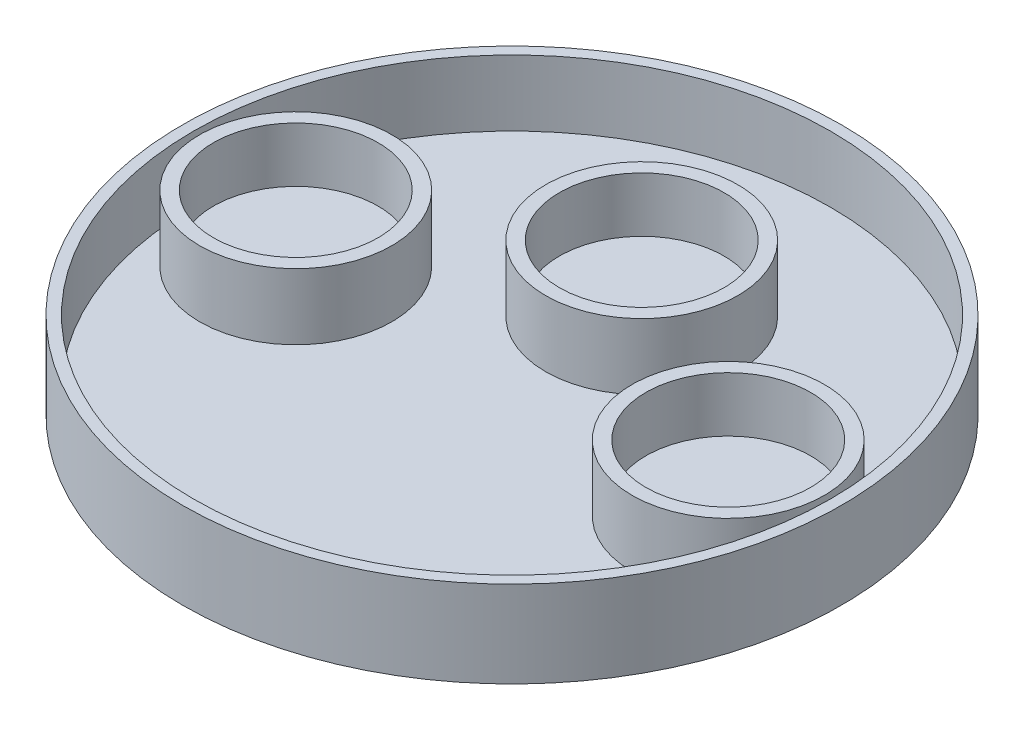
ISO-10303-21;
HEADER;
FILE_DESCRIPTION(('STEP AP214'),'2;1');
FILE_NAME('part.step','',(''),(''),'','','');
FILE_SCHEMA(('AUTOMOTIVE_DESIGN { 1 0 10303 214 1 1 1 1 }'));
ENDSEC;
DATA;
#1=APPLICATION_CONTEXT('core data for automotive mechanical design processes');
#2=APPLICATION_PROTOCOL_DEFINITION('international standard','automotive_design',2000,#1);
#3=PRODUCT_CONTEXT('',#1,'mechanical');
#4=PRODUCT('Part','Part','',(#3));
#5=PRODUCT_RELATED_PRODUCT_CATEGORY('part','',(#4));
#6=PRODUCT_DEFINITION_FORMATION('','',#4);
#7=PRODUCT_DEFINITION_CONTEXT('part definition',#1,'design');
#8=PRODUCT_DEFINITION('design','',#6,#7);
#9=PRODUCT_DEFINITION_SHAPE('','',#8);
#10=(LENGTH_UNIT() NAMED_UNIT(*) SI_UNIT(.MILLI.,.METRE.));
#11=(NAMED_UNIT(*) PLANE_ANGLE_UNIT() SI_UNIT($,.RADIAN.));
#12=(NAMED_UNIT(*) SI_UNIT($,.STERADIAN.) SOLID_ANGLE_UNIT());
#13=UNCERTAINTY_MEASURE_WITH_UNIT(LENGTH_MEASURE(1.E-05),#10,'distance_accuracy_value','');
#14=(GEOMETRIC_REPRESENTATION_CONTEXT(3) GLOBAL_UNCERTAINTY_ASSIGNED_CONTEXT((#13)) GLOBAL_UNIT_ASSIGNED_CONTEXT((#10,
#11,#12)) REPRESENTATION_CONTEXT('',''));
#15=CARTESIAN_POINT('',(0.,0.,0.));
#16=DIRECTION('',(0.,0.,1.));
#17=DIRECTION('',(1.,0.,0.));
#18=AXIS2_PLACEMENT_3D('',#15,#16,#17);
#19=CARTESIAN_POINT('',(0.,10.,0.));
#20=DIRECTION('',(0.,-1.,0.));
#21=DIRECTION('',(0.,0.,-1.));
#22=AXIS2_PLACEMENT_3D('',#19,#20,#21);
#23=CYLINDRICAL_SURFACE('',#22,38.1);
#24=CARTESIAN_POINT('',(0.,10.,0.));
#25=DIRECTION('',(0.,1.,0.));
#26=DIRECTION('',(0.,0.,1.));
#27=AXIS2_PLACEMENT_3D('',#24,#25,#26);
#28=CIRCLE('',#27,38.1);
#29=CARTESIAN_POINT('',(0.,10.,38.1));
#30=VERTEX_POINT('',#29);
#31=EDGE_CURVE('E10',#30,#30,#28,.T.);
#32=ORIENTED_EDGE('',*,*,#31,.F.);
#33=EDGE_LOOP('',(#32));
#34=FACE_BOUND('',#33,.T.);
#35=CARTESIAN_POINT('',(0.,0.,0.));
#36=DIRECTION('',(0.,1.,0.));
#37=DIRECTION('',(0.,0.,1.));
#38=AXIS2_PLACEMENT_3D('',#35,#36,#37);
#39=CIRCLE('',#38,38.1);
#40=CARTESIAN_POINT('',(0.,0.,38.1));
#41=VERTEX_POINT('',#40);
#42=EDGE_CURVE('E39',#41,#41,#39,.T.);
#43=ORIENTED_EDGE('',*,*,#42,.T.);
#44=EDGE_LOOP('',(#43));
#45=FACE_BOUND('',#44,.T.);
#46=ADVANCED_FACE('F36',(#34,#45),#23,.T.);
#47=CARTESIAN_POINT('',(0.,10.,0.));
#48=DIRECTION('',(0.,1.,0.));
#49=DIRECTION('',(0.,0.,1.));
#50=AXIS2_PLACEMENT_3D('',#47,#48,#49);
#51=PLANE('',#50);
#52=CARTESIAN_POINT('',(0.,10.,0.));
#53=DIRECTION('',(0.,1.,0.));
#54=DIRECTION('',(0.,0.,1.));
#55=AXIS2_PLACEMENT_3D('',#52,#53,#54);
#56=CIRCLE('',#55,36.83);
#57=CARTESIAN_POINT('',(0.,10.,36.83));
#58=VERTEX_POINT('',#57);
#59=EDGE_CURVE('E74',#58,#58,#56,.T.);
#60=ORIENTED_EDGE('',*,*,#59,.F.);
#61=EDGE_LOOP('',(#60));
#62=FACE_BOUND('',#61,.T.);
#63=ORIENTED_EDGE('',*,*,#31,.T.);
#64=EDGE_LOOP('',(#63));
#65=FACE_BOUND('',#64,.T.);
#66=ADVANCED_FACE('F127',(#62,#65),#51,.T.);
#67=CARTESIAN_POINT('',(0.,0.,0.));
#68=DIRECTION('',(0.,1.,0.));
#69=DIRECTION('',(0.,0.,1.));
#70=AXIS2_PLACEMENT_3D('',#67,#68,#69);
#71=PLANE('',#70);
#72=ORIENTED_EDGE('',*,*,#42,.F.);
#73=EDGE_LOOP('',(#72));
#74=FACE_BOUND('',#73,.T.);
#75=ADVANCED_FACE('F123',(#74),#71,.F.);
#76=CARTESIAN_POINT('',(0.,2.38,0.));
#77=DIRECTION('',(0.,1.,0.));
#78=DIRECTION('',(0.,0.,1.));
#79=AXIS2_PLACEMENT_3D('',#76,#77,#78);
#80=CYLINDRICAL_SURFACE('',#79,36.83);
#81=CARTESIAN_POINT('',(0.,2.38,0.));
#82=DIRECTION('',(0.,1.,0.));
#83=DIRECTION('',(0.,0.,1.));
#84=AXIS2_PLACEMENT_3D('',#81,#82,#83);
#85=CIRCLE('',#84,36.83);
#86=CARTESIAN_POINT('',(0.,2.38,36.83));
#87=VERTEX_POINT('',#86);
#88=EDGE_CURVE('E55',#87,#87,#85,.T.);
#89=ORIENTED_EDGE('',*,*,#88,.F.);
#90=EDGE_LOOP('',(#89));
#91=FACE_BOUND('',#90,.T.);
#92=ORIENTED_EDGE('',*,*,#59,.T.);
#93=EDGE_LOOP('',(#92));
#94=FACE_BOUND('',#93,.T.);
#95=ADVANCED_FACE('F113',(#91,#94),#80,.F.);
#96=CARTESIAN_POINT('',(0.,2.38,0.));
#97=DIRECTION('',(0.,1.,0.));
#98=DIRECTION('',(0.,0.,1.));
#99=AXIS2_PLACEMENT_3D('',#96,#97,#98);
#100=PLANE('',#99);
#101=CARTESIAN_POINT('',(-25.,2.38,0.));
#102=DIRECTION('',(0.,1.,0.));
#103=DIRECTION('',(0.,0.,1.));
#104=AXIS2_PLACEMENT_3D('',#101,#102,#103);
#105=CIRCLE('',#104,11.115);
#106=CARTESIAN_POINT('',(-25.,2.38,11.115));
#107=VERTEX_POINT('',#106);
#108=EDGE_CURVE('E94',#107,#107,#105,.T.);
#109=ORIENTED_EDGE('',*,*,#108,.F.);
#110=EDGE_LOOP('',(#109));
#111=FACE_BOUND('',#110,.T.);
#112=CARTESIAN_POINT('',(25.,2.38,0.));
#113=DIRECTION('',(0.,1.,0.));
#114=DIRECTION('',(0.,0.,1.));
#115=AXIS2_PLACEMENT_3D('',#112,#113,#114);
#116=CIRCLE('',#115,11.115);
#117=CARTESIAN_POINT('',(25.,2.38,11.115));
#118=VERTEX_POINT('',#117);
#119=EDGE_CURVE('E86',#118,#118,#116,.T.);
#120=ORIENTED_EDGE('',*,*,#119,.F.);
#121=EDGE_LOOP('',(#120));
#122=FACE_BOUND('',#121,.T.);
#123=CARTESIAN_POINT('',(0.,2.38,-15.));
#124=DIRECTION('',(0.,1.,0.));
#125=DIRECTION('',(0.,0.,1.));
#126=AXIS2_PLACEMENT_3D('',#123,#124,#125);
#127=CIRCLE('',#126,11.1125);
#128=CARTESIAN_POINT('',(0.,2.38,-3.8875));
#129=VERTEX_POINT('',#128);
#130=EDGE_CURVE('E78',#129,#129,#127,.T.);
#131=ORIENTED_EDGE('',*,*,#130,.F.);
#132=EDGE_LOOP('',(#131));
#133=FACE_BOUND('',#132,.T.);
#134=ORIENTED_EDGE('',*,*,#88,.T.);
#135=EDGE_LOOP('',(#134));
#136=FACE_BOUND('',#135,.T.);
#137=ADVANCED_FACE('F109',(#111,#122,#133,#136),#100,.T.);
#138=CARTESIAN_POINT('',(0.,2.38,-15.));
#139=DIRECTION('',(0.,1.,0.));
#140=DIRECTION('',(0.,0.,1.));
#141=AXIS2_PLACEMENT_3D('',#138,#139,#140);
#142=CYLINDRICAL_SURFACE('',#141,11.1125);
#143=ORIENTED_EDGE('',*,*,#130,.T.);
#144=EDGE_LOOP('',(#143));
#145=FACE_BOUND('',#144,.T.);
#146=CARTESIAN_POINT('',(0.,10.,-15.));
#147=DIRECTION('',(0.,1.,0.));
#148=DIRECTION('',(0.,0.,1.));
#149=AXIS2_PLACEMENT_3D('',#146,#147,#148);
#150=CIRCLE('',#149,11.1125);
#151=CARTESIAN_POINT('',(0.,10.,-3.8875));
#152=VERTEX_POINT('',#151);
#153=EDGE_CURVE('E82',#152,#152,#150,.T.);
#154=ORIENTED_EDGE('',*,*,#153,.F.);
#155=EDGE_LOOP('',(#154));
#156=FACE_BOUND('',#155,.T.);
#157=ADVANCED_FACE('F112',(#145,#156),#142,.T.);
#158=CARTESIAN_POINT('',(25.,2.38,0.));
#159=DIRECTION('',(0.,1.,0.));
#160=DIRECTION('',(0.,0.,1.));
#161=AXIS2_PLACEMENT_3D('',#158,#159,#160);
#162=CYLINDRICAL_SURFACE('',#161,11.115);
#163=ORIENTED_EDGE('',*,*,#119,.T.);
#164=EDGE_LOOP('',(#163));
#165=FACE_BOUND('',#164,.T.);
#166=CARTESIAN_POINT('',(25.,10.,0.));
#167=DIRECTION('',(0.,1.,0.));
#168=DIRECTION('',(0.,0.,1.));
#169=AXIS2_PLACEMENT_3D('',#166,#167,#168);
#170=CIRCLE('',#169,11.115);
#171=CARTESIAN_POINT('',(25.,10.,11.115));
#172=VERTEX_POINT('',#171);
#173=EDGE_CURVE('E90',#172,#172,#170,.T.);
#174=ORIENTED_EDGE('',*,*,#173,.F.);
#175=EDGE_LOOP('',(#174));
#176=FACE_BOUND('',#175,.T.);
#177=ADVANCED_FACE('F171',(#165,#176),#162,.T.);
#178=CARTESIAN_POINT('',(-25.,2.38,0.));
#179=DIRECTION('',(0.,1.,0.));
#180=DIRECTION('',(0.,0.,1.));
#181=AXIS2_PLACEMENT_3D('',#178,#179,#180);
#182=CYLINDRICAL_SURFACE('',#181,11.115);
#183=ORIENTED_EDGE('',*,*,#108,.T.);
#184=EDGE_LOOP('',(#183));
#185=FACE_BOUND('',#184,.T.);
#186=CARTESIAN_POINT('',(-25.,10.,0.));
#187=DIRECTION('',(0.,1.,0.));
#188=DIRECTION('',(0.,0.,1.));
#189=AXIS2_PLACEMENT_3D('',#186,#187,#188);
#190=CIRCLE('',#189,11.115);
#191=CARTESIAN_POINT('',(-25.,10.,11.115));
#192=VERTEX_POINT('',#191);
#193=EDGE_CURVE('E98',#192,#192,#190,.T.);
#194=ORIENTED_EDGE('',*,*,#193,.F.);
#195=EDGE_LOOP('',(#194));
#196=FACE_BOUND('',#195,.T.);
#197=ADVANCED_FACE('F106',(#185,#196),#182,.T.);
#198=CARTESIAN_POINT('',(25.,3.65,0.));
#199=DIRECTION('',(0.,1.,0.));
#200=DIRECTION('',(0.,0.,1.));
#201=AXIS2_PLACEMENT_3D('',#198,#199,#200);
#202=PLANE('',#201);
#203=CARTESIAN_POINT('',(25.,3.65,0.));
#204=DIRECTION('',(0.,1.,0.));
#205=DIRECTION('',(0.,0.,1.));
#206=AXIS2_PLACEMENT_3D('',#203,#204,#205);
#207=CIRCLE('',#206,9.525);
#208=CARTESIAN_POINT('',(25.,3.65,9.525));
#209=VERTEX_POINT('',#208);
#210=EDGE_CURVE('E48',#209,#209,#207,.T.);
#211=ORIENTED_EDGE('',*,*,#210,.T.);
#212=EDGE_LOOP('',(#211));
#213=FACE_BOUND('',#212,.T.);
#214=ADVANCED_FACE('F164',(#213),#202,.T.);
#215=CARTESIAN_POINT('',(25.,3.65,0.));
#216=DIRECTION('',(0.,1.,0.));
#217=DIRECTION('',(0.,0.,1.));
#218=AXIS2_PLACEMENT_3D('',#215,#216,#217);
#219=CYLINDRICAL_SURFACE('',#218,9.525);
#220=ORIENTED_EDGE('',*,*,#210,.F.);
#221=EDGE_LOOP('',(#220));
#222=FACE_BOUND('',#221,.T.);
#223=CARTESIAN_POINT('',(25.,10.,0.));
#224=DIRECTION('',(0.,1.,0.));
#225=DIRECTION('',(0.,0.,1.));
#226=AXIS2_PLACEMENT_3D('',#223,#224,#225);
#227=CIRCLE('',#226,9.525);
#228=CARTESIAN_POINT('',(25.,10.,9.525));
#229=VERTEX_POINT('',#228);
#230=EDGE_CURVE('E67',#229,#229,#227,.T.);
#231=ORIENTED_EDGE('',*,*,#230,.T.);
#232=EDGE_LOOP('',(#231));
#233=FACE_BOUND('',#232,.T.);
#234=ADVANCED_FACE('F156',(#222,#233),#219,.F.);
#235=ORIENTED_EDGE('',*,*,#230,.F.);
#236=EDGE_LOOP('',(#235));
#237=FACE_BOUND('',#236,.T.);
#238=ORIENTED_EDGE('',*,*,#173,.T.);
#239=EDGE_LOOP('',(#238));
#240=FACE_BOUND('',#239,.T.);
#241=ADVANCED_FACE('F143',(#237,#240),#51,.T.);
#242=CARTESIAN_POINT('',(0.,3.65,-15.));
#243=DIRECTION('',(0.,1.,0.));
#244=DIRECTION('',(0.,0.,1.));
#245=AXIS2_PLACEMENT_3D('',#242,#243,#244);
#246=PLANE('',#245);
#247=CARTESIAN_POINT('',(0.,3.65,-15.));
#248=DIRECTION('',(0.,1.,0.));
#249=DIRECTION('',(0.,0.,1.));
#250=AXIS2_PLACEMENT_3D('',#247,#248,#249);
#251=CIRCLE('',#250,9.525);
#252=CARTESIAN_POINT('',(0.,3.65,-5.475));
#253=VERTEX_POINT('',#252);
#254=EDGE_CURVE('E54',#253,#253,#251,.T.);
#255=ORIENTED_EDGE('',*,*,#254,.T.);
#256=EDGE_LOOP('',(#255));
#257=FACE_BOUND('',#256,.T.);
#258=ADVANCED_FACE('F155',(#257),#246,.T.);
#259=CARTESIAN_POINT('',(0.,3.65,-15.));
#260=DIRECTION('',(0.,1.,0.));
#261=DIRECTION('',(0.,0.,1.));
#262=AXIS2_PLACEMENT_3D('',#259,#260,#261);
#263=CYLINDRICAL_SURFACE('',#262,9.525);
#264=ORIENTED_EDGE('',*,*,#254,.F.);
#265=EDGE_LOOP('',(#264));
#266=FACE_BOUND('',#265,.T.);
#267=CARTESIAN_POINT('',(0.,10.,-15.));
#268=DIRECTION('',(0.,1.,0.));
#269=DIRECTION('',(0.,0.,1.));
#270=AXIS2_PLACEMENT_3D('',#267,#268,#269);
#271=CIRCLE('',#270,9.525);
#272=CARTESIAN_POINT('',(0.,10.,-5.475));
#273=VERTEX_POINT('',#272);
#274=EDGE_CURVE('E50',#273,#273,#271,.T.);
#275=ORIENTED_EDGE('',*,*,#274,.T.);
#276=EDGE_LOOP('',(#275));
#277=FACE_BOUND('',#276,.T.);
#278=ADVANCED_FACE('F141',(#266,#277),#263,.F.);
#279=ORIENTED_EDGE('',*,*,#274,.F.);
#280=EDGE_LOOP('',(#279));
#281=FACE_BOUND('',#280,.T.);
#282=ORIENTED_EDGE('',*,*,#153,.T.);
#283=EDGE_LOOP('',(#282));
#284=FACE_BOUND('',#283,.T.);
#285=ADVANCED_FACE('F130',(#281,#284),#51,.T.);
#286=CARTESIAN_POINT('',(-25.,3.65,0.));
#287=DIRECTION('',(0.,1.,0.));
#288=DIRECTION('',(0.,0.,1.));
#289=AXIS2_PLACEMENT_3D('',#286,#287,#288);
#290=PLANE('',#289);
#291=CARTESIAN_POINT('',(-25.,3.65,0.));
#292=DIRECTION('',(0.,1.,0.));
#293=DIRECTION('',(0.,0.,1.));
#294=AXIS2_PLACEMENT_3D('',#291,#292,#293);
#295=CIRCLE('',#294,9.525);
#296=CARTESIAN_POINT('',(-25.,3.65,9.525));
#297=VERTEX_POINT('',#296);
#298=EDGE_CURVE('E63',#297,#297,#295,.T.);
#299=ORIENTED_EDGE('',*,*,#298,.T.);
#300=EDGE_LOOP('',(#299));
#301=FACE_BOUND('',#300,.T.);
#302=ADVANCED_FACE('F140',(#301),#290,.T.);
#303=CARTESIAN_POINT('',(-25.,3.65,0.));
#304=DIRECTION('',(0.,1.,0.));
#305=DIRECTION('',(0.,0.,1.));
#306=AXIS2_PLACEMENT_3D('',#303,#304,#305);
#307=CYLINDRICAL_SURFACE('',#306,9.525);
#308=ORIENTED_EDGE('',*,*,#298,.F.);
#309=EDGE_LOOP('',(#308));
#310=FACE_BOUND('',#309,.T.);
#311=CARTESIAN_POINT('',(-25.,10.,0.));
#312=DIRECTION('',(0.,1.,0.));
#313=DIRECTION('',(0.,0.,1.));
#314=AXIS2_PLACEMENT_3D('',#311,#312,#313);
#315=CIRCLE('',#314,9.525);
#316=CARTESIAN_POINT('',(-25.,10.,9.525));
#317=VERTEX_POINT('',#316);
#318=EDGE_CURVE('E59',#317,#317,#315,.T.);
#319=ORIENTED_EDGE('',*,*,#318,.T.);
#320=EDGE_LOOP('',(#319));
#321=FACE_BOUND('',#320,.T.);
#322=ADVANCED_FACE('F145',(#310,#321),#307,.F.);
#323=ORIENTED_EDGE('',*,*,#318,.F.);
#324=EDGE_LOOP('',(#323));
#325=FACE_BOUND('',#324,.T.);
#326=ORIENTED_EDGE('',*,*,#193,.T.);
#327=EDGE_LOOP('',(#326));
#328=FACE_BOUND('',#327,.T.);
#329=ADVANCED_FACE('F131',(#325,#328),#51,.T.);
#330=CLOSED_SHELL('',(#46,#66,#75,#95,#137,#157,#177,#197,#214,#234,#241,#258,#278,#285,#302,
#322,#329));
#331=MANIFOLD_SOLID_BREP('B2',#330);
#332=ADVANCED_BREP_SHAPE_REPRESENTATION('',(#18,#331),#14);
#333=SHAPE_DEFINITION_REPRESENTATION(#9,#332);
ENDSEC;
END-ISO-10303-21;
